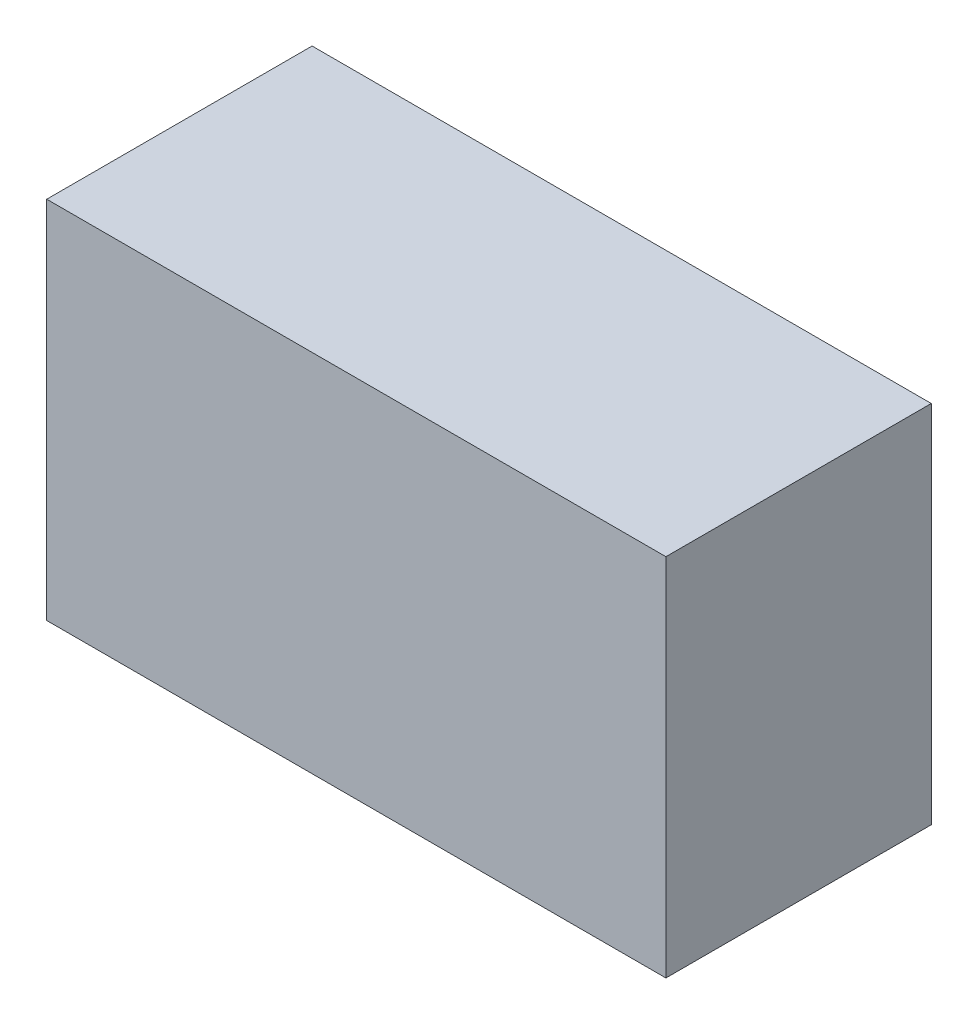
ISO-10303-21;
HEADER;
FILE_DESCRIPTION(('STEP AP214'),'2;1');
FILE_NAME('part.step','',(''),(''),'','','');
FILE_SCHEMA(('AUTOMOTIVE_DESIGN { 1 0 10303 214 1 1 1 1 }'));
ENDSEC;
DATA;
#1=APPLICATION_CONTEXT('core data for automotive mechanical design processes');
#2=APPLICATION_PROTOCOL_DEFINITION('international standard','automotive_design',2000,#1);
#3=PRODUCT_CONTEXT('',#1,'mechanical');
#4=PRODUCT('Part','Part','',(#3));
#5=PRODUCT_RELATED_PRODUCT_CATEGORY('part','',(#4));
#6=PRODUCT_DEFINITION_FORMATION('','',#4);
#7=PRODUCT_DEFINITION_CONTEXT('part definition',#1,'design');
#8=PRODUCT_DEFINITION('design','',#6,#7);
#9=PRODUCT_DEFINITION_SHAPE('','',#8);
#10=(LENGTH_UNIT() NAMED_UNIT(*) SI_UNIT(.MILLI.,.METRE.));
#11=(NAMED_UNIT(*) PLANE_ANGLE_UNIT() SI_UNIT($,.RADIAN.));
#12=(NAMED_UNIT(*) SI_UNIT($,.STERADIAN.) SOLID_ANGLE_UNIT());
#13=UNCERTAINTY_MEASURE_WITH_UNIT(LENGTH_MEASURE(1.E-05),#10,'distance_accuracy_value','');
#14=(GEOMETRIC_REPRESENTATION_CONTEXT(3) GLOBAL_UNCERTAINTY_ASSIGNED_CONTEXT((#13)) GLOBAL_UNIT_ASSIGNED_CONTEXT((#10,
#11,#12)) REPRESENTATION_CONTEXT('',''));
#15=CARTESIAN_POINT('',(0.,0.,0.));
#16=DIRECTION('',(0.,0.,1.));
#17=DIRECTION('',(1.,0.,0.));
#18=AXIS2_PLACEMENT_3D('',#15,#16,#17);
#19=CARTESIAN_POINT('',(-355.6,209.55,152.4));
#20=DIRECTION('',(1.,0.,0.));
#21=DIRECTION('',(0.,1.,0.));
#22=AXIS2_PLACEMENT_3D('',#19,#20,#21);
#23=PLANE('',#22);
#24=DIRECTION('',(0.,-1.,0.));
#25=VECTOR('',#24,1.);
#26=CARTESIAN_POINT('',(-355.6,209.55,-152.4));
#27=LINE('',#26,#25);
#28=CARTESIAN_POINT('',(-355.6,209.55,-152.4));
#29=VERTEX_POINT('',#28);
#30=CARTESIAN_POINT('',(-355.6,-209.55,-152.4));
#31=VERTEX_POINT('',#30);
#32=EDGE_CURVE('E98',#29,#31,#27,.T.);
#33=ORIENTED_EDGE('',*,*,#32,.T.);
#34=DIRECTION('',(0.,0.,-1.));
#35=VECTOR('',#34,1.);
#36=CARTESIAN_POINT('',(-355.6,-209.55,152.4));
#37=LINE('',#36,#35);
#38=CARTESIAN_POINT('',(-355.6,-209.55,152.4));
#39=VERTEX_POINT('',#38);
#40=EDGE_CURVE('E11',#39,#31,#37,.T.);
#41=ORIENTED_EDGE('',*,*,#40,.F.);
#42=DIRECTION('',(0.,-1.,0.));
#43=VECTOR('',#42,1.);
#44=CARTESIAN_POINT('',(-355.6,209.55,152.4));
#45=LINE('',#44,#43);
#46=CARTESIAN_POINT('',(-355.6,209.55,152.4));
#47=VERTEX_POINT('',#46);
#48=EDGE_CURVE('E86',#47,#39,#45,.T.);
#49=ORIENTED_EDGE('',*,*,#48,.F.);
#50=DIRECTION('',(0.,0.,-1.));
#51=VECTOR('',#50,1.);
#52=CARTESIAN_POINT('',(-355.6,209.55,152.4));
#53=LINE('',#52,#51);
#54=EDGE_CURVE('E94',#47,#29,#53,.T.);
#55=ORIENTED_EDGE('',*,*,#54,.T.);
#56=EDGE_LOOP('',(#33,#41,#49,#55));
#57=FACE_BOUND('',#56,.T.);
#58=ADVANCED_FACE('F35',(#57),#23,.F.);
#59=CARTESIAN_POINT('',(-355.6,-209.55,152.4));
#60=DIRECTION('',(0.,1.,0.));
#61=DIRECTION('',(0.,0.,1.));
#62=AXIS2_PLACEMENT_3D('',#59,#60,#61);
#63=PLANE('',#62);
#64=DIRECTION('',(1.,0.,0.));
#65=VECTOR('',#64,1.);
#66=CARTESIAN_POINT('',(-355.6,-209.55,-152.4));
#67=LINE('',#66,#65);
#68=CARTESIAN_POINT('',(355.6,-209.55,-152.4));
#69=VERTEX_POINT('',#68);
#70=EDGE_CURVE('E90',#31,#69,#67,.T.);
#71=ORIENTED_EDGE('',*,*,#70,.T.);
#72=DIRECTION('',(0.,0.,-1.));
#73=VECTOR('',#72,1.);
#74=CARTESIAN_POINT('',(355.6,-209.55,152.4));
#75=LINE('',#74,#73);
#76=CARTESIAN_POINT('',(355.6,-209.55,152.4));
#77=VERTEX_POINT('',#76);
#78=EDGE_CURVE('E43',#77,#69,#75,.T.);
#79=ORIENTED_EDGE('',*,*,#78,.F.);
#80=DIRECTION('',(1.,0.,0.));
#81=VECTOR('',#80,1.);
#82=CARTESIAN_POINT('',(-355.6,-209.55,152.4));
#83=LINE('',#82,#81);
#84=EDGE_CURVE('E81',#39,#77,#83,.T.);
#85=ORIENTED_EDGE('',*,*,#84,.F.);
#86=ORIENTED_EDGE('',*,*,#40,.T.);
#87=EDGE_LOOP('',(#71,#79,#85,#86));
#88=FACE_BOUND('',#87,.T.);
#89=ADVANCED_FACE('F89',(#88),#63,.F.);
#90=CARTESIAN_POINT('',(355.6,209.55,152.4));
#91=DIRECTION('',(-1.,0.,0.));
#92=DIRECTION('',(0.,0.,1.));
#93=AXIS2_PLACEMENT_3D('',#90,#91,#92);
#94=PLANE('',#93);
#95=DIRECTION('',(0.,1.,0.));
#96=VECTOR('',#95,1.);
#97=CARTESIAN_POINT('',(355.6,209.55,-152.4));
#98=LINE('',#97,#96);
#99=CARTESIAN_POINT('',(355.6,209.55,-152.4));
#100=VERTEX_POINT('',#99);
#101=EDGE_CURVE('E68',#69,#100,#98,.T.);
#102=ORIENTED_EDGE('',*,*,#101,.T.);
#103=DIRECTION('',(0.,0.,-1.));
#104=VECTOR('',#103,1.);
#105=CARTESIAN_POINT('',(355.6,209.55,152.4));
#106=LINE('',#105,#104);
#107=CARTESIAN_POINT('',(355.6,209.55,152.4));
#108=VERTEX_POINT('',#107);
#109=EDGE_CURVE('E91',#108,#100,#106,.T.);
#110=ORIENTED_EDGE('',*,*,#109,.F.);
#111=DIRECTION('',(0.,1.,0.));
#112=VECTOR('',#111,1.);
#113=CARTESIAN_POINT('',(355.6,209.55,152.4));
#114=LINE('',#113,#112);
#115=EDGE_CURVE('E84',#77,#108,#114,.T.);
#116=ORIENTED_EDGE('',*,*,#115,.F.);
#117=ORIENTED_EDGE('',*,*,#78,.T.);
#118=EDGE_LOOP('',(#102,#110,#116,#117));
#119=FACE_BOUND('',#118,.T.);
#120=ADVANCED_FACE('F92',(#119),#94,.F.);
#121=CARTESIAN_POINT('',(-355.6,209.55,152.4));
#122=DIRECTION('',(0.,-1.,0.));
#123=DIRECTION('',(0.,0.,-1.));
#124=AXIS2_PLACEMENT_3D('',#121,#122,#123);
#125=PLANE('',#124);
#126=DIRECTION('',(-1.,0.,0.));
#127=VECTOR('',#126,1.);
#128=CARTESIAN_POINT('',(-355.6,209.55,-152.4));
#129=LINE('',#128,#127);
#130=EDGE_CURVE('E74',#100,#29,#129,.T.);
#131=ORIENTED_EDGE('',*,*,#130,.T.);
#132=ORIENTED_EDGE('',*,*,#54,.F.);
#133=DIRECTION('',(-1.,0.,0.));
#134=VECTOR('',#133,1.);
#135=CARTESIAN_POINT('',(-355.6,209.55,152.4));
#136=LINE('',#135,#134);
#137=EDGE_CURVE('E51',#108,#47,#136,.T.);
#138=ORIENTED_EDGE('',*,*,#137,.F.);
#139=ORIENTED_EDGE('',*,*,#109,.T.);
#140=EDGE_LOOP('',(#131,#132,#138,#139));
#141=FACE_BOUND('',#140,.T.);
#142=ADVANCED_FACE('F105',(#141),#125,.F.);
#143=CARTESIAN_POINT('',(0.,0.,152.4));
#144=DIRECTION('',(0.,0.,1.));
#145=DIRECTION('',(1.,0.,0.));
#146=AXIS2_PLACEMENT_3D('',#143,#144,#145);
#147=PLANE('',#146);
#148=ORIENTED_EDGE('',*,*,#48,.T.);
#149=ORIENTED_EDGE('',*,*,#84,.T.);
#150=ORIENTED_EDGE('',*,*,#115,.T.);
#151=ORIENTED_EDGE('',*,*,#137,.T.);
#152=EDGE_LOOP('',(#148,#149,#150,#151));
#153=FACE_BOUND('',#152,.T.);
#154=ADVANCED_FACE('F82',(#153),#147,.T.);
#155=CARTESIAN_POINT('',(0.,0.,-152.4));
#156=DIRECTION('',(0.,0.,1.));
#157=DIRECTION('',(1.,0.,0.));
#158=AXIS2_PLACEMENT_3D('',#155,#156,#157);
#159=PLANE('',#158);
#160=ORIENTED_EDGE('',*,*,#32,.F.);
#161=ORIENTED_EDGE('',*,*,#130,.F.);
#162=ORIENTED_EDGE('',*,*,#101,.F.);
#163=ORIENTED_EDGE('',*,*,#70,.F.);
#164=EDGE_LOOP('',(#160,#161,#162,#163));
#165=FACE_BOUND('',#164,.T.);
#166=ADVANCED_FACE('F108',(#165),#159,.F.);
#167=CLOSED_SHELL('',(#58,#89,#120,#142,#154,#166));
#168=MANIFOLD_SOLID_BREP('B2',#167);
#169=ADVANCED_BREP_SHAPE_REPRESENTATION('',(#18,#168),#14);
#170=SHAPE_DEFINITION_REPRESENTATION(#9,#169);
ENDSEC;
END-ISO-10303-21;
